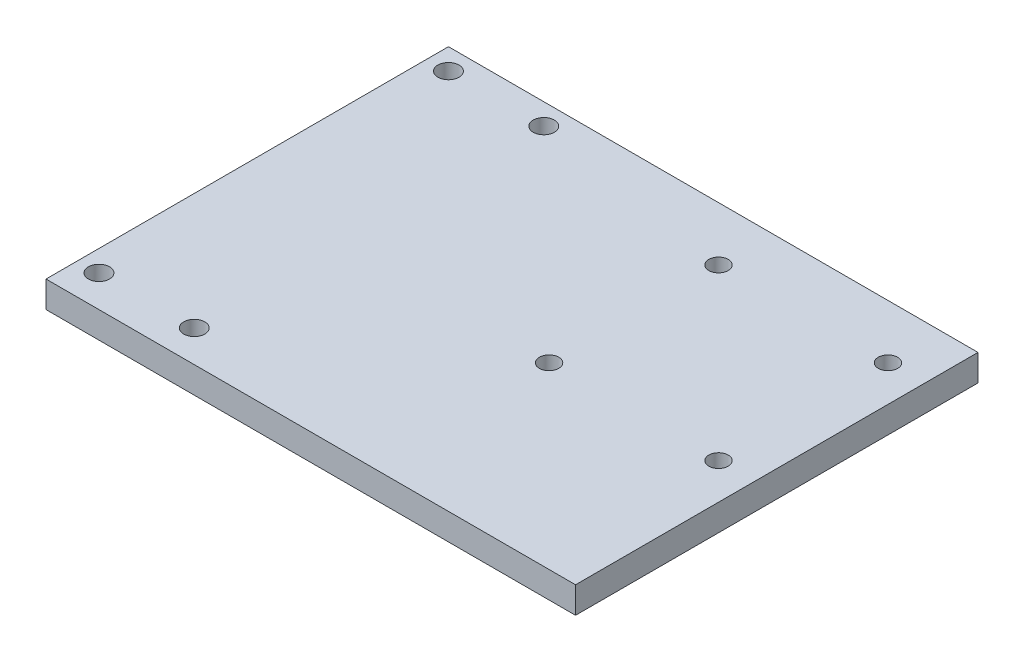
ISO-10303-21;
HEADER;
FILE_DESCRIPTION(('STEP AP214'),'2;1');
FILE_NAME('part.step','',(''),(''),'','','');
FILE_SCHEMA(('AUTOMOTIVE_DESIGN { 1 0 10303 214 1 1 1 1 }'));
ENDSEC;
DATA;
#1=APPLICATION_CONTEXT('core data for automotive mechanical design processes');
#2=APPLICATION_PROTOCOL_DEFINITION('international standard','automotive_design',2000,#1);
#3=PRODUCT_CONTEXT('',#1,'mechanical');
#4=PRODUCT('Part','Part','',(#3));
#5=PRODUCT_RELATED_PRODUCT_CATEGORY('part','',(#4));
#6=PRODUCT_DEFINITION_FORMATION('','',#4);
#7=PRODUCT_DEFINITION_CONTEXT('part definition',#1,'design');
#8=PRODUCT_DEFINITION('design','',#6,#7);
#9=PRODUCT_DEFINITION_SHAPE('','',#8);
#10=(LENGTH_UNIT() NAMED_UNIT(*) SI_UNIT(.MILLI.,.METRE.));
#11=(NAMED_UNIT(*) PLANE_ANGLE_UNIT() SI_UNIT($,.RADIAN.));
#12=(NAMED_UNIT(*) SI_UNIT($,.STERADIAN.) SOLID_ANGLE_UNIT());
#13=UNCERTAINTY_MEASURE_WITH_UNIT(LENGTH_MEASURE(1.E-05),#10,'distance_accuracy_value','');
#14=(GEOMETRIC_REPRESENTATION_CONTEXT(3) GLOBAL_UNCERTAINTY_ASSIGNED_CONTEXT((#13)) GLOBAL_UNIT_ASSIGNED_CONTEXT((#10,
#11,#12)) REPRESENTATION_CONTEXT('',''));
#15=CARTESIAN_POINT('',(0.,0.,0.));
#16=DIRECTION('',(0.,0.,1.));
#17=DIRECTION('',(1.,0.,0.));
#18=AXIS2_PLACEMENT_3D('',#15,#16,#17);
#19=CARTESIAN_POINT('',(50.,5.,38.));
#20=DIRECTION('',(-1.,0.,0.));
#21=DIRECTION('',(0.,0.,1.));
#22=AXIS2_PLACEMENT_3D('',#19,#20,#21);
#23=PLANE('',#22);
#24=DIRECTION('',(0.,0.,-1.));
#25=VECTOR('',#24,1.);
#26=CARTESIAN_POINT('',(50.,0.,38.));
#27=LINE('',#26,#25);
#28=CARTESIAN_POINT('',(50.,0.,38.));
#29=VERTEX_POINT('',#28);
#30=CARTESIAN_POINT('',(50.,0.,-38.));
#31=VERTEX_POINT('',#30);
#32=EDGE_CURVE('E96',#29,#31,#27,.T.);
#33=ORIENTED_EDGE('',*,*,#32,.T.);
#34=DIRECTION('',(0.,-1.,0.));
#35=VECTOR('',#34,1.);
#36=CARTESIAN_POINT('',(50.,5.,-38.));
#37=LINE('',#36,#35);
#38=CARTESIAN_POINT('',(50.,5.,-38.));
#39=VERTEX_POINT('',#38);
#40=EDGE_CURVE('E11',#39,#31,#37,.T.);
#41=ORIENTED_EDGE('',*,*,#40,.F.);
#42=DIRECTION('',(0.,0.,-1.));
#43=VECTOR('',#42,1.);
#44=CARTESIAN_POINT('',(50.,5.,38.));
#45=LINE('',#44,#43);
#46=CARTESIAN_POINT('',(50.,5.,38.));
#47=VERTEX_POINT('',#46);
#48=EDGE_CURVE('E84',#47,#39,#45,.T.);
#49=ORIENTED_EDGE('',*,*,#48,.F.);
#50=DIRECTION('',(0.,-1.,0.));
#51=VECTOR('',#50,1.);
#52=CARTESIAN_POINT('',(50.,5.,38.));
#53=LINE('',#52,#51);
#54=EDGE_CURVE('E92',#47,#29,#53,.T.);
#55=ORIENTED_EDGE('',*,*,#54,.T.);
#56=EDGE_LOOP('',(#33,#41,#49,#55));
#57=FACE_BOUND('',#56,.T.);
#58=ADVANCED_FACE('F33',(#57),#23,.F.);
#59=CARTESIAN_POINT('',(-50.,5.,-38.));
#60=DIRECTION('',(0.,0.,1.));
#61=DIRECTION('',(1.,0.,0.));
#62=AXIS2_PLACEMENT_3D('',#59,#60,#61);
#63=PLANE('',#62);
#64=DIRECTION('',(-1.,0.,0.));
#65=VECTOR('',#64,1.);
#66=CARTESIAN_POINT('',(-50.,0.,-38.));
#67=LINE('',#66,#65);
#68=CARTESIAN_POINT('',(-50.,0.,-38.));
#69=VERTEX_POINT('',#68);
#70=EDGE_CURVE('E88',#31,#69,#67,.T.);
#71=ORIENTED_EDGE('',*,*,#70,.T.);
#72=DIRECTION('',(0.,-1.,0.));
#73=VECTOR('',#72,1.);
#74=CARTESIAN_POINT('',(-50.,5.,-38.));
#75=LINE('',#74,#73);
#76=CARTESIAN_POINT('',(-50.,5.,-38.));
#77=VERTEX_POINT('',#76);
#78=EDGE_CURVE('E41',#77,#69,#75,.T.);
#79=ORIENTED_EDGE('',*,*,#78,.F.);
#80=DIRECTION('',(-1.,0.,0.));
#81=VECTOR('',#80,1.);
#82=CARTESIAN_POINT('',(-50.,5.,-38.));
#83=LINE('',#82,#81);
#84=EDGE_CURVE('E79',#39,#77,#83,.T.);
#85=ORIENTED_EDGE('',*,*,#84,.F.);
#86=ORIENTED_EDGE('',*,*,#40,.T.);
#87=EDGE_LOOP('',(#71,#79,#85,#86));
#88=FACE_BOUND('',#87,.T.);
#89=ADVANCED_FACE('F87',(#88),#63,.F.);
#90=CARTESIAN_POINT('',(-50.,5.,38.));
#91=DIRECTION('',(1.,0.,0.));
#92=DIRECTION('',(0.,0.,-1.));
#93=AXIS2_PLACEMENT_3D('',#90,#91,#92);
#94=PLANE('',#93);
#95=DIRECTION('',(0.,0.,1.));
#96=VECTOR('',#95,1.);
#97=CARTESIAN_POINT('',(-50.,0.,38.));
#98=LINE('',#97,#96);
#99=CARTESIAN_POINT('',(-50.,0.,38.));
#100=VERTEX_POINT('',#99);
#101=EDGE_CURVE('E66',#69,#100,#98,.T.);
#102=ORIENTED_EDGE('',*,*,#101,.T.);
#103=DIRECTION('',(0.,-1.,0.));
#104=VECTOR('',#103,1.);
#105=CARTESIAN_POINT('',(-50.,5.,38.));
#106=LINE('',#105,#104);
#107=CARTESIAN_POINT('',(-50.,5.,38.));
#108=VERTEX_POINT('',#107);
#109=EDGE_CURVE('E89',#108,#100,#106,.T.);
#110=ORIENTED_EDGE('',*,*,#109,.F.);
#111=DIRECTION('',(0.,0.,1.));
#112=VECTOR('',#111,1.);
#113=CARTESIAN_POINT('',(-50.,5.,38.));
#114=LINE('',#113,#112);
#115=EDGE_CURVE('E82',#77,#108,#114,.T.);
#116=ORIENTED_EDGE('',*,*,#115,.F.);
#117=ORIENTED_EDGE('',*,*,#78,.T.);
#118=EDGE_LOOP('',(#102,#110,#116,#117));
#119=FACE_BOUND('',#118,.T.);
#120=ADVANCED_FACE('F90',(#119),#94,.F.);
#121=CARTESIAN_POINT('',(-50.,5.,38.));
#122=DIRECTION('',(0.,0.,-1.));
#123=DIRECTION('',(-1.,0.,0.));
#124=AXIS2_PLACEMENT_3D('',#121,#122,#123);
#125=PLANE('',#124);
#126=DIRECTION('',(1.,0.,0.));
#127=VECTOR('',#126,1.);
#128=CARTESIAN_POINT('',(-50.,0.,38.));
#129=LINE('',#128,#127);
#130=EDGE_CURVE('E72',#100,#29,#129,.T.);
#131=ORIENTED_EDGE('',*,*,#130,.T.);
#132=ORIENTED_EDGE('',*,*,#54,.F.);
#133=DIRECTION('',(1.,0.,0.));
#134=VECTOR('',#133,1.);
#135=CARTESIAN_POINT('',(-50.,5.,38.));
#136=LINE('',#135,#134);
#137=EDGE_CURVE('E49',#108,#47,#136,.T.);
#138=ORIENTED_EDGE('',*,*,#137,.F.);
#139=ORIENTED_EDGE('',*,*,#109,.T.);
#140=EDGE_LOOP('',(#131,#132,#138,#139));
#141=FACE_BOUND('',#140,.T.);
#142=ADVANCED_FACE('F104',(#141),#125,.F.);
#143=CARTESIAN_POINT('',(0.,5.,0.));
#144=DIRECTION('',(0.,-1.,0.));
#145=DIRECTION('',(0.,0.,-1.));
#146=AXIS2_PLACEMENT_3D('',#143,#144,#145);
#147=PLANE('',#146);
#148=CARTESIAN_POINT('',(43.2000000000003,5.,4.20000000000001));
#149=DIRECTION('',(0.,1.,0.));
#150=DIRECTION('',(0.,0.,1.));
#151=AXIS2_PLACEMENT_3D('',#148,#149,#150);
#152=CIRCLE('',#151,1.83241989891477);
#153=CARTESIAN_POINT('',(43.2000000000003,5.,6.03241989891478));
#154=VERTEX_POINT('',#153);
#155=EDGE_CURVE('E149',#154,#154,#152,.T.);
#156=ORIENTED_EDGE('',*,*,#155,.F.);
#157=EDGE_LOOP('',(#156));
#158=FACE_BOUND('',#157,.T.);
#159=CARTESIAN_POINT('',(43.2,5.,-27.8));
#160=DIRECTION('',(0.,1.,0.));
#161=DIRECTION('',(0.,0.,1.));
#162=AXIS2_PLACEMENT_3D('',#159,#160,#161);
#163=CIRCLE('',#162,1.83241989891477);
#164=CARTESIAN_POINT('',(43.2,5.,-25.9675801010852));
#165=VERTEX_POINT('',#164);
#166=EDGE_CURVE('E143',#165,#165,#163,.T.);
#167=ORIENTED_EDGE('',*,*,#166,.F.);
#168=EDGE_LOOP('',(#167));
#169=FACE_BOUND('',#168,.T.);
#170=CARTESIAN_POINT('',(11.2000000000003,5.,4.20000000000001));
#171=DIRECTION('',(0.,1.,0.));
#172=DIRECTION('',(0.,0.,1.));
#173=AXIS2_PLACEMENT_3D('',#170,#171,#172);
#174=CIRCLE('',#173,1.83241989891477);
#175=CARTESIAN_POINT('',(11.2000000000003,5.,6.03241989891478));
#176=VERTEX_POINT('',#175);
#177=EDGE_CURVE('E137',#176,#176,#174,.T.);
#178=ORIENTED_EDGE('',*,*,#177,.F.);
#179=EDGE_LOOP('',(#178));
#180=FACE_BOUND('',#179,.T.);
#181=CARTESIAN_POINT('',(-27.9999999999984,5.,32.));
#182=DIRECTION('',(0.,1.,0.));
#183=DIRECTION('',(0.,0.,1.));
#184=AXIS2_PLACEMENT_3D('',#181,#182,#183);
#185=CIRCLE('',#184,2.00000000000001);
#186=CARTESIAN_POINT('',(-27.9999999999984,5.,34.));
#187=VERTEX_POINT('',#186);
#188=EDGE_CURVE('E131',#187,#187,#185,.T.);
#189=ORIENTED_EDGE('',*,*,#188,.F.);
#190=EDGE_LOOP('',(#189));
#191=FACE_BOUND('',#190,.T.);
#192=CARTESIAN_POINT('',(-45.9999999999984,5.,32.));
#193=DIRECTION('',(0.,1.,0.));
#194=DIRECTION('',(0.,0.,1.));
#195=AXIS2_PLACEMENT_3D('',#192,#193,#194);
#196=CIRCLE('',#195,2.);
#197=CARTESIAN_POINT('',(-45.9999999999984,5.,34.));
#198=VERTEX_POINT('',#197);
#199=EDGE_CURVE('E125',#198,#198,#196,.T.);
#200=ORIENTED_EDGE('',*,*,#199,.F.);
#201=EDGE_LOOP('',(#200));
#202=FACE_BOUND('',#201,.T.);
#203=CARTESIAN_POINT('',(11.2,5.,-27.8));
#204=DIRECTION('',(0.,1.,0.));
#205=DIRECTION('',(0.,0.,1.));
#206=AXIS2_PLACEMENT_3D('',#203,#204,#205);
#207=CIRCLE('',#206,1.83241989891478);
#208=CARTESIAN_POINT('',(11.2,5.,-25.9675801010852));
#209=VERTEX_POINT('',#208);
#210=EDGE_CURVE('E119',#209,#209,#207,.T.);
#211=ORIENTED_EDGE('',*,*,#210,.F.);
#212=EDGE_LOOP('',(#211));
#213=FACE_BOUND('',#212,.T.);
#214=CARTESIAN_POINT('',(-28.,5.,-34.));
#215=DIRECTION('',(0.,1.,0.));
#216=DIRECTION('',(0.,0.,1.));
#217=AXIS2_PLACEMENT_3D('',#214,#215,#216);
#218=CIRCLE('',#217,2.00000000000001);
#219=CARTESIAN_POINT('',(-28.,5.,-32.));
#220=VERTEX_POINT('',#219);
#221=EDGE_CURVE('E113',#220,#220,#218,.T.);
#222=ORIENTED_EDGE('',*,*,#221,.F.);
#223=EDGE_LOOP('',(#222));
#224=FACE_BOUND('',#223,.T.);
#225=CARTESIAN_POINT('',(-46.,5.,-34.));
#226=DIRECTION('',(0.,1.,0.));
#227=DIRECTION('',(0.,0.,1.));
#228=AXIS2_PLACEMENT_3D('',#225,#226,#227);
#229=CIRCLE('',#228,2.);
#230=CARTESIAN_POINT('',(-46.,5.,-32.));
#231=VERTEX_POINT('',#230);
#232=EDGE_CURVE('E99',#231,#231,#229,.T.);
#233=ORIENTED_EDGE('',*,*,#232,.F.);
#234=EDGE_LOOP('',(#233));
#235=FACE_BOUND('',#234,.T.);
#236=ORIENTED_EDGE('',*,*,#48,.T.);
#237=ORIENTED_EDGE('',*,*,#84,.T.);
#238=ORIENTED_EDGE('',*,*,#115,.T.);
#239=ORIENTED_EDGE('',*,*,#137,.T.);
#240=EDGE_LOOP('',(#236,#237,#238,#239));
#241=FACE_BOUND('',#240,.T.);
#242=ADVANCED_FACE('F80',(#158,#169,#180,#191,#202,#213,#224,#235,#241),#147,.F.);
#243=CARTESIAN_POINT('',(0.,0.,0.));
#244=DIRECTION('',(0.,-1.,0.));
#245=DIRECTION('',(0.,0.,-1.));
#246=AXIS2_PLACEMENT_3D('',#243,#244,#245);
#247=PLANE('',#246);
#248=CARTESIAN_POINT('',(43.2000000000003,0.,4.20000000000001));
#249=DIRECTION('',(0.,-1.,0.));
#250=DIRECTION('',(0.,0.,-1.));
#251=AXIS2_PLACEMENT_3D('',#248,#249,#250);
#252=CIRCLE('',#251,1.83241989891477);
#253=CARTESIAN_POINT('',(43.2000000000003,0.,2.36758010108524));
#254=VERTEX_POINT('',#253);
#255=EDGE_CURVE('E152',#254,#254,#252,.F.);
#256=ORIENTED_EDGE('',*,*,#255,.T.);
#257=EDGE_LOOP('',(#256));
#258=FACE_BOUND('',#257,.T.);
#259=CARTESIAN_POINT('',(43.2,0.,-27.8));
#260=DIRECTION('',(0.,-1.,0.));
#261=DIRECTION('',(0.,0.,-1.));
#262=AXIS2_PLACEMENT_3D('',#259,#260,#261);
#263=CIRCLE('',#262,1.83241989891477);
#264=CARTESIAN_POINT('',(43.2,0.,-29.6324198989148));
#265=VERTEX_POINT('',#264);
#266=EDGE_CURVE('E146',#265,#265,#263,.F.);
#267=ORIENTED_EDGE('',*,*,#266,.T.);
#268=EDGE_LOOP('',(#267));
#269=FACE_BOUND('',#268,.T.);
#270=CARTESIAN_POINT('',(11.2000000000003,0.,4.20000000000001));
#271=DIRECTION('',(0.,-1.,0.));
#272=DIRECTION('',(0.,0.,-1.));
#273=AXIS2_PLACEMENT_3D('',#270,#271,#272);
#274=CIRCLE('',#273,1.83241989891477);
#275=CARTESIAN_POINT('',(11.2000000000003,0.,2.36758010108524));
#276=VERTEX_POINT('',#275);
#277=EDGE_CURVE('E140',#276,#276,#274,.F.);
#278=ORIENTED_EDGE('',*,*,#277,.T.);
#279=EDGE_LOOP('',(#278));
#280=FACE_BOUND('',#279,.T.);
#281=CARTESIAN_POINT('',(-27.9999999999984,0.,32.));
#282=DIRECTION('',(0.,-1.,0.));
#283=DIRECTION('',(0.,0.,-1.));
#284=AXIS2_PLACEMENT_3D('',#281,#282,#283);
#285=CIRCLE('',#284,2.00000000000001);
#286=CARTESIAN_POINT('',(-27.9999999999984,0.,30.));
#287=VERTEX_POINT('',#286);
#288=EDGE_CURVE('E134',#287,#287,#285,.F.);
#289=ORIENTED_EDGE('',*,*,#288,.T.);
#290=EDGE_LOOP('',(#289));
#291=FACE_BOUND('',#290,.T.);
#292=CARTESIAN_POINT('',(-45.9999999999984,0.,32.));
#293=DIRECTION('',(0.,-1.,0.));
#294=DIRECTION('',(0.,0.,-1.));
#295=AXIS2_PLACEMENT_3D('',#292,#293,#294);
#296=CIRCLE('',#295,2.);
#297=CARTESIAN_POINT('',(-45.9999999999984,0.,30.));
#298=VERTEX_POINT('',#297);
#299=EDGE_CURVE('E128',#298,#298,#296,.F.);
#300=ORIENTED_EDGE('',*,*,#299,.T.);
#301=EDGE_LOOP('',(#300));
#302=FACE_BOUND('',#301,.T.);
#303=CARTESIAN_POINT('',(11.2,0.,-27.8));
#304=DIRECTION('',(0.,-1.,0.));
#305=DIRECTION('',(0.,0.,-1.));
#306=AXIS2_PLACEMENT_3D('',#303,#304,#305);
#307=CIRCLE('',#306,1.83241989891478);
#308=CARTESIAN_POINT('',(11.2,0.,-29.6324198989148));
#309=VERTEX_POINT('',#308);
#310=EDGE_CURVE('E122',#309,#309,#307,.F.);
#311=ORIENTED_EDGE('',*,*,#310,.T.);
#312=EDGE_LOOP('',(#311));
#313=FACE_BOUND('',#312,.T.);
#314=CARTESIAN_POINT('',(-28.,0.,-34.));
#315=DIRECTION('',(0.,-1.,0.));
#316=DIRECTION('',(0.,0.,-1.));
#317=AXIS2_PLACEMENT_3D('',#314,#315,#316);
#318=CIRCLE('',#317,2.00000000000001);
#319=CARTESIAN_POINT('',(-28.,0.,-36.));
#320=VERTEX_POINT('',#319);
#321=EDGE_CURVE('E116',#320,#320,#318,.F.);
#322=ORIENTED_EDGE('',*,*,#321,.T.);
#323=EDGE_LOOP('',(#322));
#324=FACE_BOUND('',#323,.T.);
#325=CARTESIAN_POINT('',(-46.,0.,-34.));
#326=DIRECTION('',(0.,-1.,0.));
#327=DIRECTION('',(0.,0.,-1.));
#328=AXIS2_PLACEMENT_3D('',#325,#326,#327);
#329=CIRCLE('',#328,2.);
#330=CARTESIAN_POINT('',(-46.,0.,-36.));
#331=VERTEX_POINT('',#330);
#332=EDGE_CURVE('E110',#331,#331,#329,.F.);
#333=ORIENTED_EDGE('',*,*,#332,.T.);
#334=EDGE_LOOP('',(#333));
#335=FACE_BOUND('',#334,.T.);
#336=ORIENTED_EDGE('',*,*,#32,.F.);
#337=ORIENTED_EDGE('',*,*,#130,.F.);
#338=ORIENTED_EDGE('',*,*,#101,.F.);
#339=ORIENTED_EDGE('',*,*,#70,.F.);
#340=EDGE_LOOP('',(#336,#337,#338,#339));
#341=FACE_BOUND('',#340,.T.);
#342=ADVANCED_FACE('F107',(#258,#269,#280,#291,#302,#313,#324,#335,#341),#247,.T.);
#343=CARTESIAN_POINT('',(-46.,-0.00100000000000013,-34.));
#344=DIRECTION('',(0.,1.,0.));
#345=DIRECTION('',(0.,0.,1.));
#346=AXIS2_PLACEMENT_3D('',#343,#344,#345);
#347=CYLINDRICAL_SURFACE('',#346,2.);
#348=ORIENTED_EDGE('',*,*,#332,.F.);
#349=EDGE_LOOP('',(#348));
#350=FACE_BOUND('',#349,.T.);
#351=ORIENTED_EDGE('',*,*,#232,.T.);
#352=EDGE_LOOP('',(#351));
#353=FACE_BOUND('',#352,.T.);
#354=ADVANCED_FACE('F177',(#350,#353),#347,.F.);
#355=CARTESIAN_POINT('',(-28.,-0.00100000000000013,-34.));
#356=DIRECTION('',(0.,1.,0.));
#357=DIRECTION('',(0.,0.,1.));
#358=AXIS2_PLACEMENT_3D('',#355,#356,#357);
#359=CYLINDRICAL_SURFACE('',#358,2.00000000000001);
#360=ORIENTED_EDGE('',*,*,#321,.F.);
#361=EDGE_LOOP('',(#360));
#362=FACE_BOUND('',#361,.T.);
#363=ORIENTED_EDGE('',*,*,#221,.T.);
#364=EDGE_LOOP('',(#363));
#365=FACE_BOUND('',#364,.T.);
#366=ADVANCED_FACE('F179',(#362,#365),#359,.F.);
#367=CARTESIAN_POINT('',(11.2,-0.00100000000000013,-27.8));
#368=DIRECTION('',(0.,1.,0.));
#369=DIRECTION('',(0.,0.,1.));
#370=AXIS2_PLACEMENT_3D('',#367,#368,#369);
#371=CYLINDRICAL_SURFACE('',#370,1.83241989891478);
#372=ORIENTED_EDGE('',*,*,#310,.F.);
#373=EDGE_LOOP('',(#372));
#374=FACE_BOUND('',#373,.T.);
#375=ORIENTED_EDGE('',*,*,#210,.T.);
#376=EDGE_LOOP('',(#375));
#377=FACE_BOUND('',#376,.T.);
#378=ADVANCED_FACE('F186',(#374,#377),#371,.F.);
#379=CARTESIAN_POINT('',(-45.9999999999984,-0.00100000000000013,32.));
#380=DIRECTION('',(0.,1.,0.));
#381=DIRECTION('',(0.,0.,1.));
#382=AXIS2_PLACEMENT_3D('',#379,#380,#381);
#383=CYLINDRICAL_SURFACE('',#382,2.);
#384=ORIENTED_EDGE('',*,*,#299,.F.);
#385=EDGE_LOOP('',(#384));
#386=FACE_BOUND('',#385,.T.);
#387=ORIENTED_EDGE('',*,*,#199,.T.);
#388=EDGE_LOOP('',(#387));
#389=FACE_BOUND('',#388,.T.);
#390=ADVANCED_FACE('F233',(#386,#389),#383,.F.);
#391=CARTESIAN_POINT('',(-27.9999999999984,-0.00100000000000013,32.));
#392=DIRECTION('',(0.,1.,0.));
#393=DIRECTION('',(0.,0.,1.));
#394=AXIS2_PLACEMENT_3D('',#391,#392,#393);
#395=CYLINDRICAL_SURFACE('',#394,2.00000000000001);
#396=ORIENTED_EDGE('',*,*,#288,.F.);
#397=EDGE_LOOP('',(#396));
#398=FACE_BOUND('',#397,.T.);
#399=ORIENTED_EDGE('',*,*,#188,.T.);
#400=EDGE_LOOP('',(#399));
#401=FACE_BOUND('',#400,.T.);
#402=ADVANCED_FACE('F243',(#398,#401),#395,.F.);
#403=CARTESIAN_POINT('',(11.2000000000003,-0.00100000000000013,4.20000000000001));
#404=DIRECTION('',(0.,1.,0.));
#405=DIRECTION('',(0.,0.,1.));
#406=AXIS2_PLACEMENT_3D('',#403,#404,#405);
#407=CYLINDRICAL_SURFACE('',#406,1.83241989891477);
#408=ORIENTED_EDGE('',*,*,#277,.F.);
#409=EDGE_LOOP('',(#408));
#410=FACE_BOUND('',#409,.T.);
#411=ORIENTED_EDGE('',*,*,#177,.T.);
#412=EDGE_LOOP('',(#411));
#413=FACE_BOUND('',#412,.T.);
#414=ADVANCED_FACE('F253',(#410,#413),#407,.F.);
#415=CARTESIAN_POINT('',(43.2,-0.00100000000000013,-27.8));
#416=DIRECTION('',(0.,1.,0.));
#417=DIRECTION('',(0.,0.,1.));
#418=AXIS2_PLACEMENT_3D('',#415,#416,#417);
#419=CYLINDRICAL_SURFACE('',#418,1.83241989891477);
#420=ORIENTED_EDGE('',*,*,#266,.F.);
#421=EDGE_LOOP('',(#420));
#422=FACE_BOUND('',#421,.T.);
#423=ORIENTED_EDGE('',*,*,#166,.T.);
#424=EDGE_LOOP('',(#423));
#425=FACE_BOUND('',#424,.T.);
#426=ADVANCED_FACE('F263',(#422,#425),#419,.F.);
#427=CARTESIAN_POINT('',(43.2000000000003,-0.00100000000000013,4.20000000000001));
#428=DIRECTION('',(0.,1.,0.));
#429=DIRECTION('',(0.,0.,1.));
#430=AXIS2_PLACEMENT_3D('',#427,#428,#429);
#431=CYLINDRICAL_SURFACE('',#430,1.83241989891477);
#432=ORIENTED_EDGE('',*,*,#255,.F.);
#433=EDGE_LOOP('',(#432));
#434=FACE_BOUND('',#433,.T.);
#435=ORIENTED_EDGE('',*,*,#155,.T.);
#436=EDGE_LOOP('',(#435));
#437=FACE_BOUND('',#436,.T.);
#438=ADVANCED_FACE('F158',(#434,#437),#431,.F.);
#439=CLOSED_SHELL('',(#58,#89,#120,#142,#242,#342,#354,#366,#378,#390,#402,#414,#426,#438));
#440=MANIFOLD_SOLID_BREP('B2',#439);
#441=ADVANCED_BREP_SHAPE_REPRESENTATION('',(#18,#440),#14);
#442=SHAPE_DEFINITION_REPRESENTATION(#9,#441);
ENDSEC;
END-ISO-10303-21;
